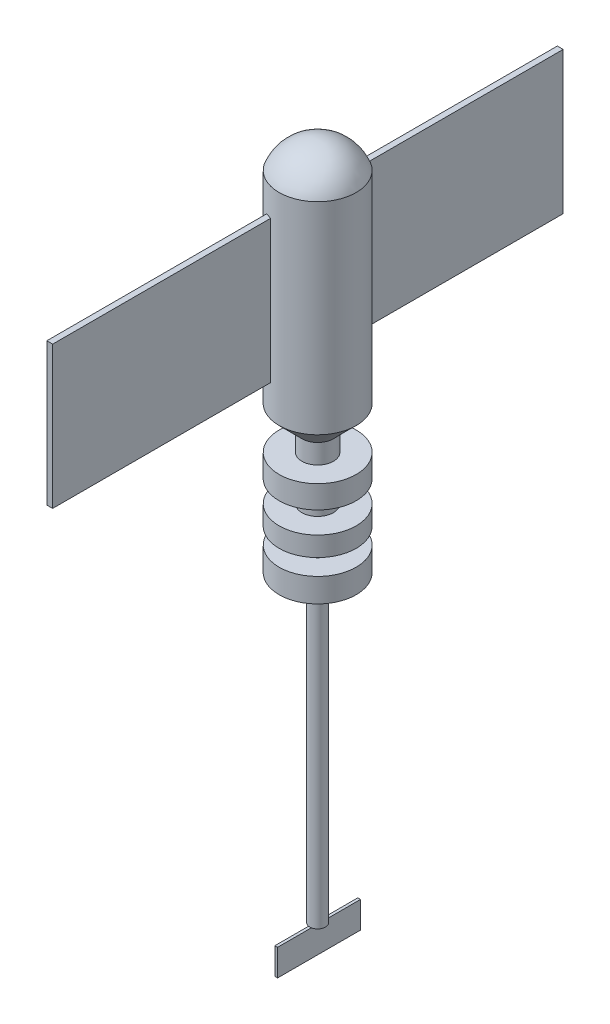
ISO-10303-21;
HEADER;
FILE_DESCRIPTION(('STEP AP214'),'2;1');
FILE_NAME('part.step','',(''),(''),'','','');
FILE_SCHEMA(('AUTOMOTIVE_DESIGN { 1 0 10303 214 1 1 1 1 }'));
ENDSEC;
DATA;
#1=APPLICATION_CONTEXT('core data for automotive mechanical design processes');
#2=APPLICATION_PROTOCOL_DEFINITION('international standard','automotive_design',2000,#1);
#3=PRODUCT_CONTEXT('',#1,'mechanical');
#4=PRODUCT('Part','Part','',(#3));
#5=PRODUCT_RELATED_PRODUCT_CATEGORY('part','',(#4));
#6=PRODUCT_DEFINITION_FORMATION('','',#4);
#7=PRODUCT_DEFINITION_CONTEXT('part definition',#1,'design');
#8=PRODUCT_DEFINITION('design','',#6,#7);
#9=PRODUCT_DEFINITION_SHAPE('','',#8);
#10=(LENGTH_UNIT() NAMED_UNIT(*) SI_UNIT(.MILLI.,.METRE.));
#11=(NAMED_UNIT(*) PLANE_ANGLE_UNIT() SI_UNIT($,.RADIAN.));
#12=(NAMED_UNIT(*) SI_UNIT($,.STERADIAN.) SOLID_ANGLE_UNIT());
#13=UNCERTAINTY_MEASURE_WITH_UNIT(LENGTH_MEASURE(1.E-05),#10,'distance_accuracy_value','');
#14=(GEOMETRIC_REPRESENTATION_CONTEXT(3) GLOBAL_UNCERTAINTY_ASSIGNED_CONTEXT((#13)) GLOBAL_UNIT_ASSIGNED_CONTEXT((#10,
#11,#12)) REPRESENTATION_CONTEXT('',''));
#15=CARTESIAN_POINT('',(0.,0.,0.));
#16=DIRECTION('',(0.,0.,1.));
#17=DIRECTION('',(1.,0.,0.));
#18=AXIS2_PLACEMENT_3D('',#15,#16,#17);
#19=CARTESIAN_POINT('',(0.,-166.648358244937,0.));
#20=DIRECTION('',(0.,-1.,0.));
#21=DIRECTION('',(0.,0.,-1.));
#22=AXIS2_PLACEMENT_3D('',#19,#20,#21);
#23=PLANE('',#22);
#24=DIRECTION('',(0.,0.,1.));
#25=VECTOR('',#24,1.);
#26=CARTESIAN_POINT('',(0.514040147839998,-166.648358244937,15.5970549991292));
#27=LINE('',#26,#25);
#28=CARTESIAN_POINT('',(0.514040147839998,-166.648358244937,-2.89048990421957));
#29=VERTEX_POINT('',#28);
#30=CARTESIAN_POINT('',(0.514040147839998,-166.648358244937,2.89048990421957));
#31=VERTEX_POINT('',#30);
#32=EDGE_CURVE('E11',#29,#31,#27,.T.);
#33=ORIENTED_EDGE('',*,*,#32,.F.);
#34=CARTESIAN_POINT('',(0.,-166.648358244937,0.));
#35=DIRECTION('',(0.,-1.,0.));
#36=DIRECTION('',(0.,0.,-1.));
#37=AXIS2_PLACEMENT_3D('',#34,#35,#36);
#38=CIRCLE('',#37,2.93584215515525);
#39=EDGE_CURVE('E180',#29,#31,#38,.T.);
#40=ORIENTED_EDGE('',*,*,#39,.T.);
#41=EDGE_LOOP('',(#33,#40));
#42=FACE_BOUND('',#41,.T.);
#43=ADVANCED_FACE('F39',(#42),#23,.T.);
#44=CARTESIAN_POINT('',(0.,93.052912246866,0.));
#45=DIRECTION('',(0.,1.,0.));
#46=DIRECTION('',(0.,0.,1.));
#47=AXIS2_PLACEMENT_3D('',#44,#45,#46);
#48=CYLINDRICAL_SURFACE('',#47,14.4885016875603);
#49=DIRECTION('',(0.,1.,0.));
#50=VECTOR('',#49,1.);
#51=CARTESIAN_POINT('',(-3.66296689072832,93.052912246866,-14.0178227520491));
#52=LINE('',#51,#50);
#53=CARTESIAN_POINT('',(-3.66296689072832,67.9089929555294,-14.0178227520491));
#54=VERTEX_POINT('',#53);
#55=CARTESIAN_POINT('',(-3.66296689072831,14.395012464784,-14.0178227520491));
#56=VERTEX_POINT('',#55);
#57=EDGE_CURVE('E43',#54,#56,#52,.F.);
#58=ORIENTED_EDGE('',*,*,#57,.F.);
#59=CARTESIAN_POINT('',(0.,67.9089929555294,0.));
#60=DIRECTION('',(0.,1.,0.));
#61=DIRECTION('',(0.,0.,1.));
#62=AXIS2_PLACEMENT_3D('',#59,#60,#61);
#63=CIRCLE('',#62,14.4885016875603);
#64=CARTESIAN_POINT('',(-5.86181383511076,67.9089929555294,-13.2497479112978));
#65=VERTEX_POINT('',#64);
#66=EDGE_CURVE('E322',#65,#54,#63,.F.);
#67=ORIENTED_EDGE('',*,*,#66,.F.);
#68=DIRECTION('',(0.,1.,0.));
#69=VECTOR('',#68,1.);
#70=CARTESIAN_POINT('',(-5.86181383511076,93.052912246866,-13.2497479112978));
#71=LINE('',#70,#69);
#72=CARTESIAN_POINT('',(-5.86181383511076,14.395012464784,-13.2497479112978));
#73=VERTEX_POINT('',#72);
#74=EDGE_CURVE('E326',#73,#65,#71,.T.);
#75=ORIENTED_EDGE('',*,*,#74,.F.);
#76=CARTESIAN_POINT('',(0.,14.395012464784,0.));
#77=DIRECTION('',(0.,-1.,0.));
#78=DIRECTION('',(0.,0.,-1.));
#79=AXIS2_PLACEMENT_3D('',#76,#77,#78);
#80=CIRCLE('',#79,14.4885016875603);
#81=EDGE_CURVE('E329',#56,#73,#80,.F.);
#82=ORIENTED_EDGE('',*,*,#81,.F.);
#83=EDGE_LOOP('',(#58,#67,#75,#82));
#84=FACE_BOUND('',#83,.T.);
#85=CARTESIAN_POINT('',(0.,2.44876084860174,0.));
#86=DIRECTION('',(0.,1.,0.));
#87=DIRECTION('',(0.,0.,1.));
#88=AXIS2_PLACEMENT_3D('',#85,#86,#87);
#89=CIRCLE('',#88,14.4885016875603);
#90=CARTESIAN_POINT('',(0.,2.44876084860174,14.4885016875603));
#91=VERTEX_POINT('',#90);
#92=EDGE_CURVE('E298',#91,#91,#89,.T.);
#93=ORIENTED_EDGE('',*,*,#92,.T.);
#94=EDGE_LOOP('',(#93));
#95=FACE_BOUND('',#94,.T.);
#96=CARTESIAN_POINT('',(0.,78.3603471552556,0.));
#97=DIRECTION('',(0.,1.,0.));
#98=DIRECTION('',(0.,0.,1.));
#99=AXIS2_PLACEMENT_3D('',#96,#97,#98);
#100=CIRCLE('',#99,14.4885016875603);
#101=CARTESIAN_POINT('',(0.,78.3603471552556,14.4885016875603));
#102=VERTEX_POINT('',#101);
#103=EDGE_CURVE('E302',#102,#102,#100,.T.);
#104=ORIENTED_EDGE('',*,*,#103,.F.);
#105=EDGE_LOOP('',(#104));
#106=FACE_BOUND('',#105,.T.);
#107=CARTESIAN_POINT('',(0.,67.9089929555294,0.));
#108=DIRECTION('',(0.,-1.,0.));
#109=DIRECTION('',(0.,0.,-1.));
#110=AXIS2_PLACEMENT_3D('',#107,#108,#109);
#111=CIRCLE('',#110,14.4885016875603);
#112=CARTESIAN_POINT('',(-5.86181383511076,67.9089929555294,13.2497479112978));
#113=VERTEX_POINT('',#112);
#114=CARTESIAN_POINT('',(-3.66296689072832,67.9089929555294,14.0178227520491));
#115=VERTEX_POINT('',#114);
#116=EDGE_CURVE('E314',#113,#115,#111,.F.);
#117=ORIENTED_EDGE('',*,*,#116,.T.);
#118=DIRECTION('',(0.,1.,0.));
#119=VECTOR('',#118,1.);
#120=CARTESIAN_POINT('',(-3.66296689072832,93.052912246866,14.0178227520491));
#121=LINE('',#120,#119);
#122=CARTESIAN_POINT('',(-3.66296689072831,14.395012464784,14.0178227520491));
#123=VERTEX_POINT('',#122);
#124=EDGE_CURVE('E318',#115,#123,#121,.F.);
#125=ORIENTED_EDGE('',*,*,#124,.T.);
#126=CARTESIAN_POINT('',(0.,14.395012464784,0.));
#127=DIRECTION('',(0.,1.,0.));
#128=DIRECTION('',(0.,0.,1.));
#129=AXIS2_PLACEMENT_3D('',#126,#127,#128);
#130=CIRCLE('',#129,14.4885016875603);
#131=CARTESIAN_POINT('',(-5.86181383511075,14.395012464784,13.2497479112978));
#132=VERTEX_POINT('',#131);
#133=EDGE_CURVE('E306',#123,#132,#130,.F.);
#134=ORIENTED_EDGE('',*,*,#133,.T.);
#135=DIRECTION('',(0.,1.,0.));
#136=VECTOR('',#135,1.);
#137=CARTESIAN_POINT('',(-5.86181383511076,93.052912246866,13.2497479112978));
#138=LINE('',#137,#136);
#139=EDGE_CURVE('E310',#132,#113,#138,.T.);
#140=ORIENTED_EDGE('',*,*,#139,.T.);
#141=EDGE_LOOP('',(#117,#125,#134,#140));
#142=FACE_BOUND('',#141,.T.);
#143=ADVANCED_FACE('F349',(#84,#95,#106,#142),#48,.T.);
#144=CARTESIAN_POINT('',(0.,72.8645130977337,0.));
#145=DIRECTION('',(0.,0.,1.));
#146=DIRECTION('',(1.,0.,0.));
#147=AXIS2_PLACEMENT_3D('',#144,#145,#146);
#148=SPHERICAL_SURFACE('',#147,15.4958340575218);
#149=CARTESIAN_POINT('',(0.,72.8645130977337,0.));
#150=DIRECTION('',(0.,1.,0.));
#151=DIRECTION('',(0.,0.,1.));
#152=AXIS2_PLACEMENT_3D('',#149,#150,#151);
#153=SPHERICAL_SURFACE('',#152,15.4958340575218);
#154=ORIENTED_EDGE('',*,*,#103,.T.);
#155=EDGE_LOOP('',(#154));
#156=FACE_BOUND('',#155,.T.);
#157=ADVANCED_FACE('F41',(#156),#153,.T.);
#158=CARTESIAN_POINT('',(0.,2.44876084860174,0.));
#159=DIRECTION('',(0.,1.,0.));
#160=DIRECTION('',(0.,0.,1.));
#161=AXIS2_PLACEMENT_3D('',#158,#159,#160);
#162=CONICAL_SURFACE('',#161,14.4885016875603,0.785398163397464);
#163=CARTESIAN_POINT('',(0.,-6.12190212150421,0.));
#164=DIRECTION('',(0.,1.,0.));
#165=DIRECTION('',(0.,0.,1.));
#166=AXIS2_PLACEMENT_3D('',#163,#164,#165);
#167=CIRCLE('',#166,5.91783871745406);
#168=CARTESIAN_POINT('',(0.,-6.12190212150421,5.91783871745406));
#169=VERTEX_POINT('',#168);
#170=EDGE_CURVE('E294',#169,#169,#167,.T.);
#171=ORIENTED_EDGE('',*,*,#170,.T.);
#172=EDGE_LOOP('',(#171));
#173=FACE_BOUND('',#172,.T.);
#174=ORIENTED_EDGE('',*,*,#92,.F.);
#175=EDGE_LOOP('',(#174));
#176=FACE_BOUND('',#175,.T.);
#177=ADVANCED_FACE('F590',(#173,#176),#162,.T.);
#178=CARTESIAN_POINT('',(0.,93.052912246866,0.));
#179=DIRECTION('',(0.,1.,0.));
#180=DIRECTION('',(0.,0.,1.));
#181=AXIS2_PLACEMENT_3D('',#178,#179,#180);
#182=CYLINDRICAL_SURFACE('',#181,5.91783871745406);
#183=CARTESIAN_POINT('',(0.,-13.4681846673095,0.));
#184=DIRECTION('',(0.,1.,0.));
#185=DIRECTION('',(0.,0.,1.));
#186=AXIS2_PLACEMENT_3D('',#183,#184,#185);
#187=CIRCLE('',#186,5.91783871745406);
#188=CARTESIAN_POINT('',(0.,-13.4681846673095,5.91783871745406));
#189=VERTEX_POINT('',#188);
#190=EDGE_CURVE('E290',#189,#189,#187,.T.);
#191=ORIENTED_EDGE('',*,*,#190,.T.);
#192=EDGE_LOOP('',(#191));
#193=FACE_BOUND('',#192,.T.);
#194=ORIENTED_EDGE('',*,*,#170,.F.);
#195=EDGE_LOOP('',(#194));
#196=FACE_BOUND('',#195,.T.);
#197=ADVANCED_FACE('F596',(#193,#196),#182,.T.);
#198=CARTESIAN_POINT('',(-5.91783871745406,-13.4681846673095,0.));
#199=DIRECTION('',(0.,1.,0.));
#200=DIRECTION('',(0.,0.,1.));
#201=AXIS2_PLACEMENT_3D('',#198,#199,#200);
#202=PLANE('',#201);
#203=CARTESIAN_POINT('',(0.,-13.4681846673095,0.));
#204=DIRECTION('',(0.,1.,0.));
#205=DIRECTION('',(0.,0.,1.));
#206=AXIS2_PLACEMENT_3D('',#203,#204,#205);
#207=CIRCLE('',#206,14.4885016875603);
#208=CARTESIAN_POINT('',(0.,-13.4681846673095,14.4885016875603));
#209=VERTEX_POINT('',#208);
#210=EDGE_CURVE('E286',#209,#209,#207,.T.);
#211=ORIENTED_EDGE('',*,*,#210,.T.);
#212=EDGE_LOOP('',(#211));
#213=FACE_BOUND('',#212,.T.);
#214=ORIENTED_EDGE('',*,*,#190,.F.);
#215=EDGE_LOOP('',(#214));
#216=FACE_BOUND('',#215,.T.);
#217=ADVANCED_FACE('F604',(#213,#216),#202,.T.);
#218=CARTESIAN_POINT('',(0.,93.052912246866,0.));
#219=DIRECTION('',(0.,1.,0.));
#220=DIRECTION('',(0.,0.,1.));
#221=AXIS2_PLACEMENT_3D('',#218,#219,#220);
#222=CYLINDRICAL_SURFACE('',#221,14.4885016875603);
#223=CARTESIAN_POINT('',(0.,-22.0388476374156,0.));
#224=DIRECTION('',(0.,1.,0.));
#225=DIRECTION('',(0.,0.,1.));
#226=AXIS2_PLACEMENT_3D('',#223,#224,#225);
#227=CIRCLE('',#226,14.4885016875603);
#228=CARTESIAN_POINT('',(0.,-22.0388476374156,14.4885016875603));
#229=VERTEX_POINT('',#228);
#230=EDGE_CURVE('E282',#229,#229,#227,.T.);
#231=ORIENTED_EDGE('',*,*,#230,.T.);
#232=EDGE_LOOP('',(#231));
#233=FACE_BOUND('',#232,.T.);
#234=ORIENTED_EDGE('',*,*,#210,.F.);
#235=EDGE_LOOP('',(#234));
#236=FACE_BOUND('',#235,.T.);
#237=ADVANCED_FACE('F612',(#233,#236),#222,.T.);
#238=CARTESIAN_POINT('',(-14.4885016875603,-22.0388476374156,0.));
#239=DIRECTION('',(0.,-1.,0.));
#240=DIRECTION('',(0.,0.,-1.));
#241=AXIS2_PLACEMENT_3D('',#238,#239,#240);
#242=PLANE('',#241);
#243=CARTESIAN_POINT('',(0.,-22.0388476374156,0.));
#244=DIRECTION('',(0.,1.,0.));
#245=DIRECTION('',(0.,0.,1.));
#246=AXIS2_PLACEMENT_3D('',#243,#244,#245);
#247=CIRCLE('',#246,5.91783871745406);
#248=CARTESIAN_POINT('',(0.,-22.0388476374156,5.91783871745406));
#249=VERTEX_POINT('',#248);
#250=EDGE_CURVE('E278',#249,#249,#247,.T.);
#251=ORIENTED_EDGE('',*,*,#250,.T.);
#252=EDGE_LOOP('',(#251));
#253=FACE_BOUND('',#252,.T.);
#254=ORIENTED_EDGE('',*,*,#230,.F.);
#255=EDGE_LOOP('',(#254));
#256=FACE_BOUND('',#255,.T.);
#257=ADVANCED_FACE('F620',(#253,#256),#242,.T.);
#258=CARTESIAN_POINT('',(0.,93.052912246866,0.));
#259=DIRECTION('',(0.,1.,0.));
#260=DIRECTION('',(0.,0.,1.));
#261=AXIS2_PLACEMENT_3D('',#258,#259,#260);
#262=CYLINDRICAL_SURFACE('',#261,5.91783871745406);
#263=CARTESIAN_POINT('',(0.,-30.2013837994214,0.));
#264=DIRECTION('',(0.,1.,0.));
#265=DIRECTION('',(0.,0.,1.));
#266=AXIS2_PLACEMENT_3D('',#263,#264,#265);
#267=CIRCLE('',#266,5.91783871745406);
#268=CARTESIAN_POINT('',(0.,-30.2013837994214,5.91783871745406));
#269=VERTEX_POINT('',#268);
#270=EDGE_CURVE('E274',#269,#269,#267,.T.);
#271=ORIENTED_EDGE('',*,*,#270,.T.);
#272=EDGE_LOOP('',(#271));
#273=FACE_BOUND('',#272,.T.);
#274=ORIENTED_EDGE('',*,*,#250,.F.);
#275=EDGE_LOOP('',(#274));
#276=FACE_BOUND('',#275,.T.);
#277=ADVANCED_FACE('F628',(#273,#276),#262,.T.);
#278=CARTESIAN_POINT('',(-5.91783871745406,-30.2013837994214,0.));
#279=DIRECTION('',(0.,1.,0.));
#280=DIRECTION('',(0.,0.,1.));
#281=AXIS2_PLACEMENT_3D('',#278,#279,#280);
#282=PLANE('',#281);
#283=CARTESIAN_POINT('',(0.,-30.2013837994214,0.));
#284=DIRECTION('',(0.,1.,0.));
#285=DIRECTION('',(0.,0.,1.));
#286=AXIS2_PLACEMENT_3D('',#283,#284,#285);
#287=CIRCLE('',#286,14.4885016875603);
#288=CARTESIAN_POINT('',(0.,-30.2013837994214,14.4885016875603));
#289=VERTEX_POINT('',#288);
#290=EDGE_CURVE('E270',#289,#289,#287,.T.);
#291=ORIENTED_EDGE('',*,*,#290,.T.);
#292=EDGE_LOOP('',(#291));
#293=FACE_BOUND('',#292,.T.);
#294=ORIENTED_EDGE('',*,*,#270,.F.);
#295=EDGE_LOOP('',(#294));
#296=FACE_BOUND('',#295,.T.);
#297=ADVANCED_FACE('F636',(#293,#296),#282,.T.);
#298=CARTESIAN_POINT('',(0.,93.052912246866,0.));
#299=DIRECTION('',(0.,1.,0.));
#300=DIRECTION('',(0.,0.,1.));
#301=AXIS2_PLACEMENT_3D('',#298,#299,#300);
#302=CYLINDRICAL_SURFACE('',#301,14.4885016875603);
#303=CARTESIAN_POINT('',(0.,-37.5476663452266,0.));
#304=DIRECTION('',(0.,1.,0.));
#305=DIRECTION('',(0.,0.,1.));
#306=AXIS2_PLACEMENT_3D('',#303,#304,#305);
#307=CIRCLE('',#306,14.4885016875603);
#308=CARTESIAN_POINT('',(0.,-37.5476663452266,14.4885016875603));
#309=VERTEX_POINT('',#308);
#310=EDGE_CURVE('E266',#309,#309,#307,.T.);
#311=ORIENTED_EDGE('',*,*,#310,.T.);
#312=EDGE_LOOP('',(#311));
#313=FACE_BOUND('',#312,.T.);
#314=ORIENTED_EDGE('',*,*,#290,.F.);
#315=EDGE_LOOP('',(#314));
#316=FACE_BOUND('',#315,.T.);
#317=ADVANCED_FACE('F644',(#313,#316),#302,.T.);
#318=CARTESIAN_POINT('',(-14.4885016875603,-37.5476663452266,0.));
#319=DIRECTION('',(0.,-1.,0.));
#320=DIRECTION('',(0.,0.,-1.));
#321=AXIS2_PLACEMENT_3D('',#318,#319,#320);
#322=PLANE('',#321);
#323=CARTESIAN_POINT('',(0.,-37.5476663452266,0.));
#324=DIRECTION('',(0.,1.,0.));
#325=DIRECTION('',(0.,0.,1.));
#326=AXIS2_PLACEMENT_3D('',#323,#324,#325);
#327=CIRCLE('',#326,5.91783871745406);
#328=CARTESIAN_POINT('',(0.,-37.5476663452266,5.91783871745406));
#329=VERTEX_POINT('',#328);
#330=EDGE_CURVE('E262',#329,#329,#327,.T.);
#331=ORIENTED_EDGE('',*,*,#330,.T.);
#332=EDGE_LOOP('',(#331));
#333=FACE_BOUND('',#332,.T.);
#334=ORIENTED_EDGE('',*,*,#310,.F.);
#335=EDGE_LOOP('',(#334));
#336=FACE_BOUND('',#335,.T.);
#337=ADVANCED_FACE('F652',(#333,#336),#322,.T.);
#338=CARTESIAN_POINT('',(0.,93.052912246866,0.));
#339=DIRECTION('',(0.,1.,0.));
#340=DIRECTION('',(0.,0.,1.));
#341=AXIS2_PLACEMENT_3D('',#338,#339,#340);
#342=CYLINDRICAL_SURFACE('',#341,5.91783871745406);
#343=CARTESIAN_POINT('',(0.,-43.669568466731,0.));
#344=DIRECTION('',(0.,1.,0.));
#345=DIRECTION('',(0.,0.,1.));
#346=AXIS2_PLACEMENT_3D('',#343,#344,#345);
#347=CIRCLE('',#346,5.91783871745406);
#348=CARTESIAN_POINT('',(0.,-43.669568466731,5.91783871745406));
#349=VERTEX_POINT('',#348);
#350=EDGE_CURVE('E258',#349,#349,#347,.T.);
#351=ORIENTED_EDGE('',*,*,#350,.T.);
#352=EDGE_LOOP('',(#351));
#353=FACE_BOUND('',#352,.T.);
#354=ORIENTED_EDGE('',*,*,#330,.F.);
#355=EDGE_LOOP('',(#354));
#356=FACE_BOUND('',#355,.T.);
#357=ADVANCED_FACE('F660',(#353,#356),#342,.T.);
#358=CARTESIAN_POINT('',(-5.91783871745406,-43.669568466731,0.));
#359=DIRECTION('',(0.,1.,0.));
#360=DIRECTION('',(0.,0.,1.));
#361=AXIS2_PLACEMENT_3D('',#358,#359,#360);
#362=PLANE('',#361);
#363=CARTESIAN_POINT('',(0.,-43.669568466731,0.));
#364=DIRECTION('',(0.,1.,0.));
#365=DIRECTION('',(0.,0.,1.));
#366=AXIS2_PLACEMENT_3D('',#363,#364,#365);
#367=CIRCLE('',#366,14.4885016875603);
#368=CARTESIAN_POINT('',(0.,-43.669568466731,14.4885016875603));
#369=VERTEX_POINT('',#368);
#370=EDGE_CURVE('E254',#369,#369,#367,.T.);
#371=ORIENTED_EDGE('',*,*,#370,.T.);
#372=EDGE_LOOP('',(#371));
#373=FACE_BOUND('',#372,.T.);
#374=ORIENTED_EDGE('',*,*,#350,.F.);
#375=EDGE_LOOP('',(#374));
#376=FACE_BOUND('',#375,.T.);
#377=ADVANCED_FACE('F667',(#373,#376),#362,.T.);
#378=CARTESIAN_POINT('',(0.,93.052912246866,0.));
#379=DIRECTION('',(0.,1.,0.));
#380=DIRECTION('',(0.,0.,1.));
#381=AXIS2_PLACEMENT_3D('',#378,#379,#380);
#382=CYLINDRICAL_SURFACE('',#381,14.4885016875603);
#383=CARTESIAN_POINT('',(0.,-52.6483582449373,0.));
#384=DIRECTION('',(0.,1.,0.));
#385=DIRECTION('',(0.,0.,1.));
#386=AXIS2_PLACEMENT_3D('',#383,#384,#385);
#387=CIRCLE('',#386,14.4885016875603);
#388=CARTESIAN_POINT('',(0.,-52.6483582449373,14.4885016875603));
#389=VERTEX_POINT('',#388);
#390=EDGE_CURVE('E250',#389,#389,#387,.T.);
#391=ORIENTED_EDGE('',*,*,#390,.T.);
#392=EDGE_LOOP('',(#391));
#393=FACE_BOUND('',#392,.T.);
#394=ORIENTED_EDGE('',*,*,#370,.F.);
#395=EDGE_LOOP('',(#394));
#396=FACE_BOUND('',#395,.T.);
#397=ADVANCED_FACE('F444',(#393,#396),#382,.T.);
#398=CARTESIAN_POINT('',(-5.91783871745406,-52.6483582449373,0.));
#399=DIRECTION('',(0.,-1.,0.));
#400=DIRECTION('',(0.,0.,-1.));
#401=AXIS2_PLACEMENT_3D('',#398,#399,#400);
#402=PLANE('',#401);
#403=CARTESIAN_POINT('',(0.,-52.6483582449373,0.));
#404=DIRECTION('',(0.,-1.,0.));
#405=DIRECTION('',(0.,0.,-1.));
#406=AXIS2_PLACEMENT_3D('',#403,#404,#405);
#407=CIRCLE('',#406,2.93584215515525);
#408=CARTESIAN_POINT('',(0.,-52.6483582449373,-2.93584215515525));
#409=VERTEX_POINT('',#408);
#410=EDGE_CURVE('E187',#409,#409,#407,.T.);
#411=ORIENTED_EDGE('',*,*,#410,.F.);
#412=EDGE_LOOP('',(#411));
#413=FACE_BOUND('',#412,.T.);
#414=ORIENTED_EDGE('',*,*,#390,.F.);
#415=EDGE_LOOP('',(#414));
#416=FACE_BOUND('',#415,.T.);
#417=ADVANCED_FACE('F440',(#413,#416),#402,.T.);
#418=CARTESIAN_POINT('',(-3.66296689072832,67.9089929555294,96.));
#419=DIRECTION('',(-1.,0.,0.));
#420=DIRECTION('',(0.,-1.,0.));
#421=AXIS2_PLACEMENT_3D('',#418,#419,#420);
#422=PLANE('',#421);
#423=ORIENTED_EDGE('',*,*,#124,.F.);
#424=DIRECTION('',(0.,0.,-1.));
#425=VECTOR('',#424,1.);
#426=CARTESIAN_POINT('',(-3.66296689072832,67.9089929555294,96.));
#427=LINE('',#426,#425);
#428=CARTESIAN_POINT('',(-3.66296689072832,67.9089929555294,96.));
#429=VERTEX_POINT('',#428);
#430=EDGE_CURVE('E246',#429,#115,#427,.T.);
#431=ORIENTED_EDGE('',*,*,#430,.F.);
#432=DIRECTION('',(0.,1.,0.));
#433=VECTOR('',#432,1.);
#434=CARTESIAN_POINT('',(-3.66296689072832,67.9089929555294,96.));
#435=LINE('',#434,#433);
#436=CARTESIAN_POINT('',(-3.66296689072831,14.395012464784,96.));
#437=VERTEX_POINT('',#436);
#438=EDGE_CURVE('E222',#437,#429,#435,.T.);
#439=ORIENTED_EDGE('',*,*,#438,.F.);
#440=DIRECTION('',(0.,0.,-1.));
#441=VECTOR('',#440,1.);
#442=CARTESIAN_POINT('',(-3.66296689072831,14.395012464784,96.));
#443=LINE('',#442,#441);
#444=EDGE_CURVE('E235',#437,#123,#443,.T.);
#445=ORIENTED_EDGE('',*,*,#444,.T.);
#446=EDGE_LOOP('',(#423,#431,#439,#445));
#447=FACE_BOUND('',#446,.T.);
#448=ADVANCED_FACE('F371',(#447),#422,.F.);
#449=CARTESIAN_POINT('',(-5.86181383511076,67.9089929555294,96.));
#450=DIRECTION('',(0.,-1.,0.));
#451=DIRECTION('',(0.,0.,-1.));
#452=AXIS2_PLACEMENT_3D('',#449,#450,#451);
#453=PLANE('',#452);
#454=ORIENTED_EDGE('',*,*,#116,.F.);
#455=DIRECTION('',(0.,0.,-1.));
#456=VECTOR('',#455,1.);
#457=CARTESIAN_POINT('',(-5.86181383511076,67.9089929555294,96.));
#458=LINE('',#457,#456);
#459=CARTESIAN_POINT('',(-5.86181383511076,67.9089929555294,96.));
#460=VERTEX_POINT('',#459);
#461=EDGE_CURVE('E242',#460,#113,#458,.T.);
#462=ORIENTED_EDGE('',*,*,#461,.F.);
#463=DIRECTION('',(-1.,0.,0.));
#464=VECTOR('',#463,1.);
#465=CARTESIAN_POINT('',(-5.86181383511076,67.9089929555294,96.));
#466=LINE('',#465,#464);
#467=EDGE_CURVE('E226',#429,#460,#466,.T.);
#468=ORIENTED_EDGE('',*,*,#467,.F.);
#469=ORIENTED_EDGE('',*,*,#430,.T.);
#470=EDGE_LOOP('',(#454,#462,#468,#469));
#471=FACE_BOUND('',#470,.T.);
#472=ADVANCED_FACE('F359',(#471),#453,.F.);
#473=CARTESIAN_POINT('',(-5.86181383511076,67.9089929555294,96.));
#474=DIRECTION('',(1.,0.,0.));
#475=DIRECTION('',(0.,1.,0.));
#476=AXIS2_PLACEMENT_3D('',#473,#474,#475);
#477=PLANE('',#476);
#478=ORIENTED_EDGE('',*,*,#139,.F.);
#479=DIRECTION('',(0.,0.,-1.));
#480=VECTOR('',#479,1.);
#481=CARTESIAN_POINT('',(-5.86181383511075,14.395012464784,96.));
#482=LINE('',#481,#480);
#483=CARTESIAN_POINT('',(-5.86181383511075,14.395012464784,96.));
#484=VERTEX_POINT('',#483);
#485=EDGE_CURVE('E239',#484,#132,#482,.T.);
#486=ORIENTED_EDGE('',*,*,#485,.F.);
#487=DIRECTION('',(0.,-1.,0.));
#488=VECTOR('',#487,1.);
#489=CARTESIAN_POINT('',(-5.86181383511076,67.9089929555294,96.));
#490=LINE('',#489,#488);
#491=EDGE_CURVE('E229',#460,#484,#490,.T.);
#492=ORIENTED_EDGE('',*,*,#491,.F.);
#493=ORIENTED_EDGE('',*,*,#461,.T.);
#494=EDGE_LOOP('',(#478,#486,#492,#493));
#495=FACE_BOUND('',#494,.T.);
#496=ADVANCED_FACE('F363',(#495),#477,.F.);
#497=CARTESIAN_POINT('',(-5.86181383511075,14.395012464784,96.));
#498=DIRECTION('',(0.,1.,0.));
#499=DIRECTION('',(0.,0.,1.));
#500=AXIS2_PLACEMENT_3D('',#497,#498,#499);
#501=PLANE('',#500);
#502=ORIENTED_EDGE('',*,*,#133,.F.);
#503=ORIENTED_EDGE('',*,*,#444,.F.);
#504=DIRECTION('',(1.,0.,0.));
#505=VECTOR('',#504,1.);
#506=CARTESIAN_POINT('',(-5.86181383511075,14.395012464784,96.));
#507=LINE('',#506,#505);
#508=EDGE_CURVE('E232',#484,#437,#507,.T.);
#509=ORIENTED_EDGE('',*,*,#508,.F.);
#510=ORIENTED_EDGE('',*,*,#485,.T.);
#511=EDGE_LOOP('',(#502,#503,#509,#510));
#512=FACE_BOUND('',#511,.T.);
#513=ADVANCED_FACE('F373',(#512),#501,.F.);
#514=CARTESIAN_POINT('',(0.,0.,96.));
#515=DIRECTION('',(0.,0.,1.));
#516=DIRECTION('',(1.,0.,0.));
#517=AXIS2_PLACEMENT_3D('',#514,#515,#516);
#518=PLANE('',#517);
#519=ORIENTED_EDGE('',*,*,#438,.T.);
#520=ORIENTED_EDGE('',*,*,#467,.T.);
#521=ORIENTED_EDGE('',*,*,#491,.T.);
#522=ORIENTED_EDGE('',*,*,#508,.T.);
#523=EDGE_LOOP('',(#519,#520,#521,#522));
#524=FACE_BOUND('',#523,.T.);
#525=ADVANCED_FACE('F367',(#524),#518,.T.);
#526=CARTESIAN_POINT('',(-3.66296689072832,67.9089929555294,-96.));
#527=DIRECTION('',(1.,0.,0.));
#528=DIRECTION('',(0.,1.,0.));
#529=AXIS2_PLACEMENT_3D('',#526,#527,#528);
#530=PLANE('',#529);
#531=DIRECTION('',(0.,0.,1.));
#532=VECTOR('',#531,1.);
#533=CARTESIAN_POINT('',(-3.66296689072832,67.9089929555294,-96.));
#534=LINE('',#533,#532);
#535=CARTESIAN_POINT('',(-3.66296689072832,67.9089929555294,-96.));
#536=VERTEX_POINT('',#535);
#537=EDGE_CURVE('E206',#536,#54,#534,.T.);
#538=ORIENTED_EDGE('',*,*,#537,.T.);
#539=ORIENTED_EDGE('',*,*,#57,.T.);
#540=DIRECTION('',(0.,0.,1.));
#541=VECTOR('',#540,1.);
#542=CARTESIAN_POINT('',(-3.66296689072831,14.395012464784,-96.));
#543=LINE('',#542,#541);
#544=CARTESIAN_POINT('',(-3.66296689072831,14.395012464784,-96.));
#545=VERTEX_POINT('',#544);
#546=EDGE_CURVE('E218',#545,#56,#543,.T.);
#547=ORIENTED_EDGE('',*,*,#546,.F.);
#548=DIRECTION('',(0.,1.,0.));
#549=VECTOR('',#548,1.);
#550=CARTESIAN_POINT('',(-3.66296689072832,67.9089929555294,-96.));
#551=LINE('',#550,#549);
#552=EDGE_CURVE('E186',#545,#536,#551,.T.);
#553=ORIENTED_EDGE('',*,*,#552,.T.);
#554=EDGE_LOOP('',(#538,#539,#547,#553));
#555=FACE_BOUND('',#554,.T.);
#556=ADVANCED_FACE('F336',(#555),#530,.T.);
#557=CARTESIAN_POINT('',(-5.86181383511075,14.395012464784,-96.));
#558=DIRECTION('',(0.,-1.,0.));
#559=DIRECTION('',(0.,0.,-1.));
#560=AXIS2_PLACEMENT_3D('',#557,#558,#559);
#561=PLANE('',#560);
#562=ORIENTED_EDGE('',*,*,#546,.T.);
#563=ORIENTED_EDGE('',*,*,#81,.T.);
#564=DIRECTION('',(0.,0.,1.));
#565=VECTOR('',#564,1.);
#566=CARTESIAN_POINT('',(-5.86181383511075,14.395012464784,-96.));
#567=LINE('',#566,#565);
#568=CARTESIAN_POINT('',(-5.86181383511075,14.395012464784,-96.));
#569=VERTEX_POINT('',#568);
#570=EDGE_CURVE('E214',#569,#73,#567,.T.);
#571=ORIENTED_EDGE('',*,*,#570,.F.);
#572=DIRECTION('',(1.,0.,0.));
#573=VECTOR('',#572,1.);
#574=CARTESIAN_POINT('',(-5.86181383511075,14.395012464784,-96.));
#575=LINE('',#574,#573);
#576=EDGE_CURVE('E194',#569,#545,#575,.T.);
#577=ORIENTED_EDGE('',*,*,#576,.T.);
#578=EDGE_LOOP('',(#562,#563,#571,#577));
#579=FACE_BOUND('',#578,.T.);
#580=ADVANCED_FACE('F339',(#579),#561,.T.);
#581=CARTESIAN_POINT('',(-5.86181383511076,67.9089929555294,-96.));
#582=DIRECTION('',(-1.,0.,0.));
#583=DIRECTION('',(0.,-1.,0.));
#584=AXIS2_PLACEMENT_3D('',#581,#582,#583);
#585=PLANE('',#584);
#586=ORIENTED_EDGE('',*,*,#570,.T.);
#587=ORIENTED_EDGE('',*,*,#74,.T.);
#588=DIRECTION('',(0.,0.,1.));
#589=VECTOR('',#588,1.);
#590=CARTESIAN_POINT('',(-5.86181383511076,67.9089929555294,-96.));
#591=LINE('',#590,#589);
#592=CARTESIAN_POINT('',(-5.86181383511076,67.9089929555294,-96.));
#593=VERTEX_POINT('',#592);
#594=EDGE_CURVE('E210',#593,#65,#591,.T.);
#595=ORIENTED_EDGE('',*,*,#594,.F.);
#596=DIRECTION('',(0.,-1.,0.));
#597=VECTOR('',#596,1.);
#598=CARTESIAN_POINT('',(-5.86181383511076,67.9089929555294,-96.));
#599=LINE('',#598,#597);
#600=EDGE_CURVE('E198',#593,#569,#599,.T.);
#601=ORIENTED_EDGE('',*,*,#600,.T.);
#602=EDGE_LOOP('',(#586,#587,#595,#601));
#603=FACE_BOUND('',#602,.T.);
#604=ADVANCED_FACE('F346',(#603),#585,.T.);
#605=CARTESIAN_POINT('',(-5.86181383511076,67.9089929555294,-96.));
#606=DIRECTION('',(0.,1.,0.));
#607=DIRECTION('',(0.,0.,1.));
#608=AXIS2_PLACEMENT_3D('',#605,#606,#607);
#609=PLANE('',#608);
#610=ORIENTED_EDGE('',*,*,#594,.T.);
#611=ORIENTED_EDGE('',*,*,#66,.T.);
#612=ORIENTED_EDGE('',*,*,#537,.F.);
#613=DIRECTION('',(-1.,0.,0.));
#614=VECTOR('',#613,1.);
#615=CARTESIAN_POINT('',(-5.86181383511076,67.9089929555294,-96.));
#616=LINE('',#615,#614);
#617=EDGE_CURVE('E202',#536,#593,#616,.T.);
#618=ORIENTED_EDGE('',*,*,#617,.T.);
#619=EDGE_LOOP('',(#610,#611,#612,#618));
#620=FACE_BOUND('',#619,.T.);
#621=ADVANCED_FACE('F348',(#620),#609,.T.);
#622=CARTESIAN_POINT('',(0.,0.,-96.));
#623=DIRECTION('',(0.,0.,-1.));
#624=DIRECTION('',(1.,0.,0.));
#625=AXIS2_PLACEMENT_3D('',#622,#623,#624);
#626=PLANE('',#625);
#627=ORIENTED_EDGE('',*,*,#552,.F.);
#628=ORIENTED_EDGE('',*,*,#576,.F.);
#629=ORIENTED_EDGE('',*,*,#600,.F.);
#630=ORIENTED_EDGE('',*,*,#617,.F.);
#631=EDGE_LOOP('',(#627,#628,#629,#630));
#632=FACE_BOUND('',#631,.T.);
#633=ADVANCED_FACE('F343',(#632),#626,.T.);
#634=CARTESIAN_POINT('',(0.,-166.648358244937,0.));
#635=DIRECTION('',(0.,1.,0.));
#636=DIRECTION('',(0.,0.,1.));
#637=AXIS2_PLACEMENT_3D('',#634,#635,#636);
#638=CYLINDRICAL_SURFACE('',#637,2.93584215515525);
#639=ORIENTED_EDGE('',*,*,#39,.F.);
#640=CARTESIAN_POINT('',(-0.514040147839998,-166.648358244937,-2.89048990421957));
#641=VERTEX_POINT('',#640);
#642=EDGE_CURVE('E173',#641,#29,#38,.T.);
#643=ORIENTED_EDGE('',*,*,#642,.F.);
#644=CARTESIAN_POINT('',(-0.514040147839998,-166.648358244937,2.89048990421957));
#645=VERTEX_POINT('',#644);
#646=EDGE_CURVE('E178',#645,#641,#38,.T.);
#647=ORIENTED_EDGE('',*,*,#646,.F.);
#648=EDGE_CURVE('E64',#31,#645,#38,.T.);
#649=ORIENTED_EDGE('',*,*,#648,.F.);
#650=EDGE_LOOP('',(#639,#643,#647,#649));
#651=FACE_BOUND('',#650,.T.);
#652=ORIENTED_EDGE('',*,*,#410,.T.);
#653=EDGE_LOOP('',(#652));
#654=FACE_BOUND('',#653,.T.);
#655=ADVANCED_FACE('F392',(#651,#654),#638,.T.);
#656=DIRECTION('',(0.,0.,-1.));
#657=VECTOR('',#656,1.);
#658=CARTESIAN_POINT('',(-0.514040147839998,-166.648358244937,15.5970549991292));
#659=LINE('',#658,#657);
#660=EDGE_CURVE('E49',#645,#641,#659,.T.);
#661=ORIENTED_EDGE('',*,*,#660,.F.);
#662=ORIENTED_EDGE('',*,*,#646,.T.);
#663=EDGE_LOOP('',(#661,#662));
#664=FACE_BOUND('',#663,.T.);
#665=ADVANCED_FACE('F385',(#664),#23,.T.);
#666=CARTESIAN_POINT('',(0.,-166.648358244937,0.));
#667=DIRECTION('',(0.,-1.,0.));
#668=DIRECTION('',(0.,0.,-1.));
#669=AXIS2_PLACEMENT_3D('',#666,#667,#668);
#670=PLANE('',#669);
#671=CARTESIAN_POINT('',(0.514040147839998,-166.648358244937,15.5970549991292));
#672=VERTEX_POINT('',#671);
#673=EDGE_CURVE('E52',#31,#672,#27,.T.);
#674=ORIENTED_EDGE('',*,*,#673,.F.);
#675=ORIENTED_EDGE('',*,*,#648,.T.);
#676=CARTESIAN_POINT('',(-0.514040147839998,-166.648358244937,15.5970549991292));
#677=VERTEX_POINT('',#676);
#678=EDGE_CURVE('E529',#677,#645,#659,.T.);
#679=ORIENTED_EDGE('',*,*,#678,.F.);
#680=DIRECTION('',(-1.,0.,0.));
#681=VECTOR('',#680,1.);
#682=CARTESIAN_POINT('',(-0.514040147839998,-166.648358244937,15.5970549991292));
#683=LINE('',#682,#681);
#684=EDGE_CURVE('E535',#672,#677,#683,.T.);
#685=ORIENTED_EDGE('',*,*,#684,.F.);
#686=EDGE_LOOP('',(#674,#675,#679,#685));
#687=FACE_BOUND('',#686,.T.);
#688=ADVANCED_FACE('F391',(#687),#670,.F.);
#689=CARTESIAN_POINT('',(-0.514040147839998,-166.648358244937,-15.5970549991292));
#690=VERTEX_POINT('',#689);
#691=EDGE_CURVE('E538',#641,#690,#659,.T.);
#692=ORIENTED_EDGE('',*,*,#691,.F.);
#693=ORIENTED_EDGE('',*,*,#642,.T.);
#694=CARTESIAN_POINT('',(0.514040147839998,-166.648358244937,-15.5970549991292));
#695=VERTEX_POINT('',#694);
#696=EDGE_CURVE('E51',#695,#29,#27,.T.);
#697=ORIENTED_EDGE('',*,*,#696,.F.);
#698=DIRECTION('',(1.,0.,0.));
#699=VECTOR('',#698,1.);
#700=CARTESIAN_POINT('',(-0.514040147839998,-166.648358244937,-15.5970549991292));
#701=LINE('',#700,#699);
#702=EDGE_CURVE('E166',#690,#695,#701,.T.);
#703=ORIENTED_EDGE('',*,*,#702,.F.);
#704=EDGE_LOOP('',(#692,#693,#697,#703));
#705=FACE_BOUND('',#704,.T.);
#706=ADVANCED_FACE('F397',(#705),#670,.F.);
#707=CARTESIAN_POINT('',(0.514040147839998,-176.648358244937,15.5970549991292));
#708=DIRECTION('',(-1.,0.,0.));
#709=DIRECTION('',(0.,0.,1.));
#710=AXIS2_PLACEMENT_3D('',#707,#708,#709);
#711=PLANE('',#710);
#712=ORIENTED_EDGE('',*,*,#696,.T.);
#713=ORIENTED_EDGE('',*,*,#32,.T.);
#714=ORIENTED_EDGE('',*,*,#673,.T.);
#715=DIRECTION('',(0.,1.,0.));
#716=VECTOR('',#715,1.);
#717=CARTESIAN_POINT('',(0.514040147839998,-176.648358244937,15.5970549991292));
#718=LINE('',#717,#716);
#719=CARTESIAN_POINT('',(0.514040147839998,-176.648358244937,15.5970549991292));
#720=VERTEX_POINT('',#719);
#721=EDGE_CURVE('E149',#720,#672,#718,.T.);
#722=ORIENTED_EDGE('',*,*,#721,.F.);
#723=DIRECTION('',(0.,0.,1.));
#724=VECTOR('',#723,1.);
#725=CARTESIAN_POINT('',(0.514040147839998,-176.648358244937,15.5970549991292));
#726=LINE('',#725,#724);
#727=CARTESIAN_POINT('',(0.514040147839998,-176.648358244937,-15.5970549991292));
#728=VERTEX_POINT('',#727);
#729=EDGE_CURVE('E156',#728,#720,#726,.T.);
#730=ORIENTED_EDGE('',*,*,#729,.F.);
#731=DIRECTION('',(0.,1.,0.));
#732=VECTOR('',#731,1.);
#733=CARTESIAN_POINT('',(0.514040147839998,-176.648358244937,-15.5970549991292));
#734=LINE('',#733,#732);
#735=EDGE_CURVE('E524',#728,#695,#734,.T.);
#736=ORIENTED_EDGE('',*,*,#735,.T.);
#737=EDGE_LOOP('',(#712,#713,#714,#722,#730,#736));
#738=FACE_BOUND('',#737,.T.);
#739=ADVANCED_FACE('F169',(#738),#711,.F.);
#740=CARTESIAN_POINT('',(-0.514040147839998,-176.648358244937,15.5970549991292));
#741=DIRECTION('',(0.,0.,-1.));
#742=DIRECTION('',(-1.,0.,0.));
#743=AXIS2_PLACEMENT_3D('',#740,#741,#742);
#744=PLANE('',#743);
#745=ORIENTED_EDGE('',*,*,#684,.T.);
#746=DIRECTION('',(0.,1.,0.));
#747=VECTOR('',#746,1.);
#748=CARTESIAN_POINT('',(-0.514040147839998,-176.648358244937,15.5970549991292));
#749=LINE('',#748,#747);
#750=CARTESIAN_POINT('',(-0.514040147839998,-176.648358244937,15.5970549991292));
#751=VERTEX_POINT('',#750);
#752=EDGE_CURVE('E151',#751,#677,#749,.T.);
#753=ORIENTED_EDGE('',*,*,#752,.F.);
#754=DIRECTION('',(-1.,0.,0.));
#755=VECTOR('',#754,1.);
#756=CARTESIAN_POINT('',(-0.514040147839998,-176.648358244937,15.5970549991292));
#757=LINE('',#756,#755);
#758=EDGE_CURVE('E145',#720,#751,#757,.T.);
#759=ORIENTED_EDGE('',*,*,#758,.F.);
#760=ORIENTED_EDGE('',*,*,#721,.T.);
#761=EDGE_LOOP('',(#745,#753,#759,#760));
#762=FACE_BOUND('',#761,.T.);
#763=ADVANCED_FACE('F147',(#762),#744,.F.);
#764=CARTESIAN_POINT('',(-0.514040147839998,-176.648358244937,15.5970549991292));
#765=DIRECTION('',(1.,0.,0.));
#766=DIRECTION('',(0.,0.,-1.));
#767=AXIS2_PLACEMENT_3D('',#764,#765,#766);
#768=PLANE('',#767);
#769=ORIENTED_EDGE('',*,*,#678,.T.);
#770=ORIENTED_EDGE('',*,*,#660,.T.);
#771=ORIENTED_EDGE('',*,*,#691,.T.);
#772=DIRECTION('',(0.,1.,0.));
#773=VECTOR('',#772,1.);
#774=CARTESIAN_POINT('',(-0.514040147839998,-176.648358244937,-15.5970549991292));
#775=LINE('',#774,#773);
#776=CARTESIAN_POINT('',(-0.514040147839998,-176.648358244937,-15.5970549991292));
#777=VERTEX_POINT('',#776);
#778=EDGE_CURVE('E181',#777,#690,#775,.T.);
#779=ORIENTED_EDGE('',*,*,#778,.F.);
#780=DIRECTION('',(0.,0.,-1.));
#781=VECTOR('',#780,1.);
#782=CARTESIAN_POINT('',(-0.514040147839998,-176.648358244937,15.5970549991292));
#783=LINE('',#782,#781);
#784=EDGE_CURVE('E155',#751,#777,#783,.T.);
#785=ORIENTED_EDGE('',*,*,#784,.F.);
#786=ORIENTED_EDGE('',*,*,#752,.T.);
#787=EDGE_LOOP('',(#769,#770,#771,#779,#785,#786));
#788=FACE_BOUND('',#787,.T.);
#789=ADVANCED_FACE('F491',(#788),#768,.F.);
#790=CARTESIAN_POINT('',(-0.514040147839998,-176.648358244937,-15.5970549991292));
#791=DIRECTION('',(0.,0.,1.));
#792=DIRECTION('',(1.,0.,0.));
#793=AXIS2_PLACEMENT_3D('',#790,#791,#792);
#794=PLANE('',#793);
#795=ORIENTED_EDGE('',*,*,#702,.T.);
#796=ORIENTED_EDGE('',*,*,#735,.F.);
#797=DIRECTION('',(1.,0.,0.));
#798=VECTOR('',#797,1.);
#799=CARTESIAN_POINT('',(-0.514040147839998,-176.648358244937,-15.5970549991292));
#800=LINE('',#799,#798);
#801=EDGE_CURVE('E161',#777,#728,#800,.T.);
#802=ORIENTED_EDGE('',*,*,#801,.F.);
#803=ORIENTED_EDGE('',*,*,#778,.T.);
#804=EDGE_LOOP('',(#795,#796,#802,#803));
#805=FACE_BOUND('',#804,.T.);
#806=ADVANCED_FACE('F500',(#805),#794,.F.);
#807=CARTESIAN_POINT('',(0.,-176.648358244937,0.));
#808=DIRECTION('',(0.,-1.,0.));
#809=DIRECTION('',(0.,0.,-1.));
#810=AXIS2_PLACEMENT_3D('',#807,#808,#809);
#811=PLANE('',#810);
#812=ORIENTED_EDGE('',*,*,#729,.T.);
#813=ORIENTED_EDGE('',*,*,#758,.T.);
#814=ORIENTED_EDGE('',*,*,#784,.T.);
#815=ORIENTED_EDGE('',*,*,#801,.T.);
#816=EDGE_LOOP('',(#812,#813,#814,#815));
#817=FACE_BOUND('',#816,.T.);
#818=ADVANCED_FACE('F159',(#817),#811,.T.);
#819=CLOSED_SHELL('',(#43,#143,#157,#177,#197,#217,#237,#257,#277,#297,#317,#337,#357,#377,#397,
#417,#448,#472,#496,#513,#525,#556,#580,#604,#621,#633,#655,#665,#688,#706,#739,#763,#789,#806,#818));
#820=MANIFOLD_SOLID_BREP('B2',#819);
#821=ADVANCED_BREP_SHAPE_REPRESENTATION('',(#18,#820),#14);
#822=SHAPE_DEFINITION_REPRESENTATION(#9,#821);
ENDSEC;
END-ISO-10303-21;
